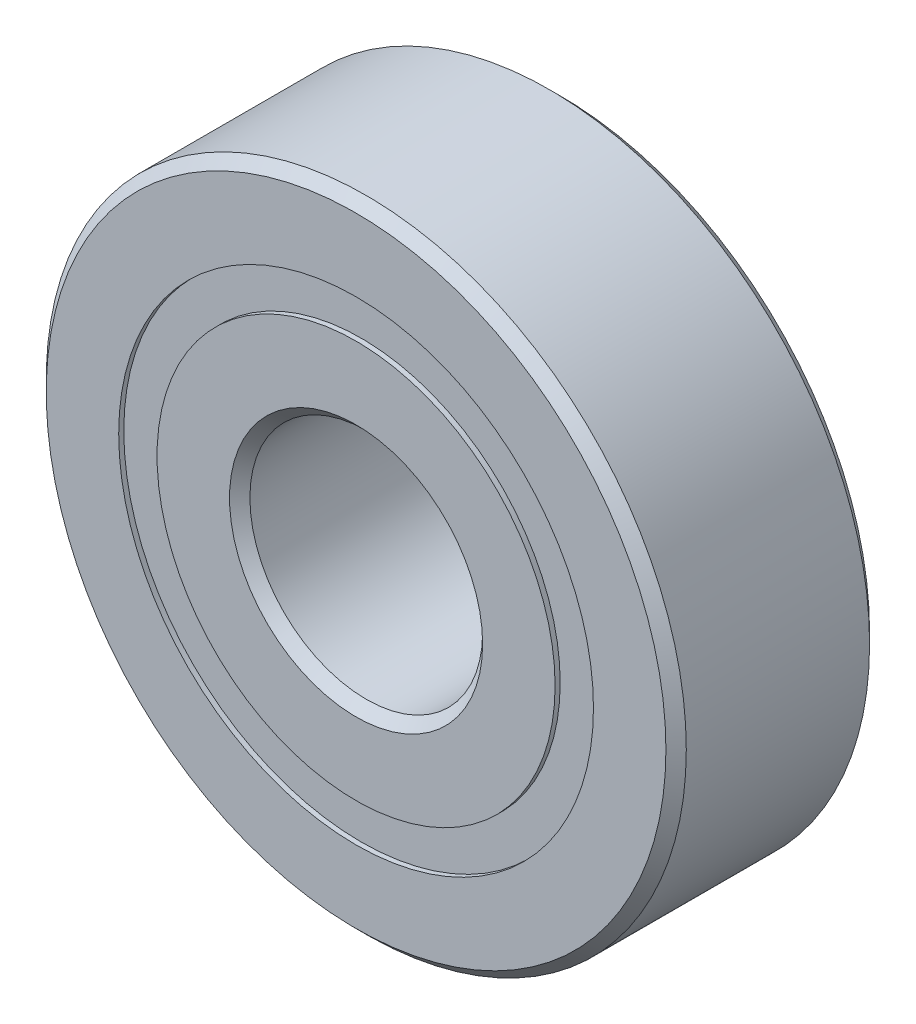
ISO-10303-21;
HEADER;
FILE_DESCRIPTION(('STEP AP214'),'2;1');
FILE_NAME('part.step','',(''),(''),'','','');
FILE_SCHEMA(('AUTOMOTIVE_DESIGN { 1 0 10303 214 1 1 1 1 }'));
ENDSEC;
DATA;
#1=APPLICATION_CONTEXT('core data for automotive mechanical design processes');
#2=APPLICATION_PROTOCOL_DEFINITION('international standard','automotive_design',2000,#1);
#3=PRODUCT_CONTEXT('',#1,'mechanical');
#4=PRODUCT('Part','Part','',(#3));
#5=PRODUCT_RELATED_PRODUCT_CATEGORY('part','',(#4));
#6=PRODUCT_DEFINITION_FORMATION('','',#4);
#7=PRODUCT_DEFINITION_CONTEXT('part definition',#1,'design');
#8=PRODUCT_DEFINITION('design','',#6,#7);
#9=PRODUCT_DEFINITION_SHAPE('','',#8);
#10=(LENGTH_UNIT() NAMED_UNIT(*) SI_UNIT(.MILLI.,.METRE.));
#11=(NAMED_UNIT(*) PLANE_ANGLE_UNIT() SI_UNIT($,.RADIAN.));
#12=(NAMED_UNIT(*) SI_UNIT($,.STERADIAN.) SOLID_ANGLE_UNIT());
#13=UNCERTAINTY_MEASURE_WITH_UNIT(LENGTH_MEASURE(1.E-05),#10,'distance_accuracy_value','');
#14=(GEOMETRIC_REPRESENTATION_CONTEXT(3) GLOBAL_UNCERTAINTY_ASSIGNED_CONTEXT((#13)) GLOBAL_UNIT_ASSIGNED_CONTEXT((#10,
#11,#12)) REPRESENTATION_CONTEXT('',''));
#15=CARTESIAN_POINT('',(0.,0.,0.));
#16=DIRECTION('',(0.,0.,1.));
#17=DIRECTION('',(1.,0.,0.));
#18=AXIS2_PLACEMENT_3D('',#15,#16,#17);
#19=CARTESIAN_POINT('',(0.,8.15934065934066,-3.325));
#20=DIRECTION('',(0.,0.,1.));
#21=DIRECTION('',(1.,0.,0.));
#22=AXIS2_PLACEMENT_3D('',#19,#20,#21);
#23=PLANE('',#22);
#24=CARTESIAN_POINT('',(0.,0.,-3.325));
#25=DIRECTION('',(0.,0.,1.));
#26=DIRECTION('',(1.,0.,0.));
#27=AXIS2_PLACEMENT_3D('',#24,#25,#26);
#28=CIRCLE('',#27,8.15934065934066);
#29=CARTESIAN_POINT('',(8.15934065934066,0.,-3.325));
#30=VERTEX_POINT('',#29);
#31=EDGE_CURVE('E57',#30,#30,#28,.T.);
#32=ORIENTED_EDGE('',*,*,#31,.F.);
#33=EDGE_LOOP('',(#32));
#34=FACE_BOUND('',#33,.T.);
#35=CARTESIAN_POINT('',(0.,0.,-3.325));
#36=DIRECTION('',(0.,0.,1.));
#37=DIRECTION('',(1.,0.,0.));
#38=AXIS2_PLACEMENT_3D('',#35,#36,#37);
#39=CIRCLE('',#38,6.84065934065934);
#40=CARTESIAN_POINT('',(6.84065934065934,0.,-3.325));
#41=VERTEX_POINT('',#40);
#42=EDGE_CURVE('E11',#41,#41,#39,.T.);
#43=ORIENTED_EDGE('',*,*,#42,.T.);
#44=EDGE_LOOP('',(#43));
#45=FACE_BOUND('',#44,.T.);
#46=ADVANCED_FACE('F43',(#34,#45),#23,.F.);
#47=CARTESIAN_POINT('',(0.,0.,3.5));
#48=DIRECTION('',(0.,0.,1.));
#49=DIRECTION('',(1.,0.,0.));
#50=AXIS2_PLACEMENT_3D('',#47,#48,#49);
#51=CYLINDRICAL_SURFACE('',#50,6.84065934065934);
#52=ORIENTED_EDGE('',*,*,#42,.F.);
#53=EDGE_LOOP('',(#52));
#54=FACE_BOUND('',#53,.T.);
#55=CARTESIAN_POINT('',(0.,0.,-1.68952158656808));
#56=DIRECTION('',(0.,0.,1.));
#57=DIRECTION('',(1.,0.,0.));
#58=AXIS2_PLACEMENT_3D('',#55,#56,#57);
#59=CIRCLE('',#58,6.84065934065934);
#60=CARTESIAN_POINT('',(6.84065934065934,0.,-1.68952158656808));
#61=VERTEX_POINT('',#60);
#62=EDGE_CURVE('E49',#61,#61,#59,.T.);
#63=ORIENTED_EDGE('',*,*,#62,.T.);
#64=EDGE_LOOP('',(#63));
#65=FACE_BOUND('',#64,.T.);
#66=ADVANCED_FACE('F66',(#54,#65),#51,.F.);
#67=CARTESIAN_POINT('',(0.,8.15934065934066,-1.68952158656808));
#68=DIRECTION('',(0.,0.,-1.));
#69=DIRECTION('',(-1.,0.,0.));
#70=AXIS2_PLACEMENT_3D('',#67,#68,#69);
#71=PLANE('',#70);
#72=ORIENTED_EDGE('',*,*,#62,.F.);
#73=EDGE_LOOP('',(#72));
#74=FACE_BOUND('',#73,.T.);
#75=CARTESIAN_POINT('',(0.,0.,-1.68952158656808));
#76=DIRECTION('',(0.,0.,1.));
#77=DIRECTION('',(1.,0.,0.));
#78=AXIS2_PLACEMENT_3D('',#75,#76,#77);
#79=CIRCLE('',#78,8.15934065934066);
#80=CARTESIAN_POINT('',(8.15934065934066,0.,-1.68952158656808));
#81=VERTEX_POINT('',#80);
#82=EDGE_CURVE('E53',#81,#81,#79,.T.);
#83=ORIENTED_EDGE('',*,*,#82,.T.);
#84=EDGE_LOOP('',(#83));
#85=FACE_BOUND('',#84,.T.);
#86=ADVANCED_FACE('F70',(#74,#85),#71,.F.);
#87=CARTESIAN_POINT('',(0.,0.,3.5));
#88=DIRECTION('',(0.,0.,1.));
#89=DIRECTION('',(1.,0.,0.));
#90=AXIS2_PLACEMENT_3D('',#87,#88,#89);
#91=CYLINDRICAL_SURFACE('',#90,8.15934065934066);
#92=ORIENTED_EDGE('',*,*,#82,.F.);
#93=EDGE_LOOP('',(#92));
#94=FACE_BOUND('',#93,.T.);
#95=ORIENTED_EDGE('',*,*,#31,.T.);
#96=EDGE_LOOP('',(#95));
#97=FACE_BOUND('',#96,.T.);
#98=ADVANCED_FACE('F63',(#94,#97),#91,.T.);
#99=CLOSED_SHELL('',(#46,#66,#86,#98));
#100=MANIFOLD_SOLID_BREP('B2',#99);
#101=CARTESIAN_POINT('',(0.,8.15934065934066,3.325));
#102=DIRECTION('',(0.,0.,-1.));
#103=DIRECTION('',(-1.,0.,0.));
#104=AXIS2_PLACEMENT_3D('',#101,#102,#103);
#105=PLANE('',#104);
#106=CARTESIAN_POINT('',(0.,0.,3.325));
#107=DIRECTION('',(0.,0.,1.));
#108=DIRECTION('',(1.,0.,0.));
#109=AXIS2_PLACEMENT_3D('',#106,#107,#108);
#110=CIRCLE('',#109,6.84065934065934);
#111=CARTESIAN_POINT('',(6.84065934065934,0.,3.325));
#112=VERTEX_POINT('',#111);
#113=EDGE_CURVE('E42',#112,#112,#110,.T.);
#114=ORIENTED_EDGE('',*,*,#113,.F.);
#115=EDGE_LOOP('',(#114));
#116=FACE_BOUND('',#115,.T.);
#117=CARTESIAN_POINT('',(0.,0.,3.325));
#118=DIRECTION('',(0.,0.,1.));
#119=DIRECTION('',(1.,0.,0.));
#120=AXIS2_PLACEMENT_3D('',#117,#118,#119);
#121=CIRCLE('',#120,8.15934065934066);
#122=CARTESIAN_POINT('',(8.15934065934066,0.,3.325));
#123=VERTEX_POINT('',#122);
#124=EDGE_CURVE('E124',#123,#123,#121,.T.);
#125=ORIENTED_EDGE('',*,*,#124,.T.);
#126=EDGE_LOOP('',(#125));
#127=FACE_BOUND('',#126,.T.);
#128=ADVANCED_FACE('F110',(#116,#127),#105,.F.);
#129=CARTESIAN_POINT('',(0.,0.,3.5));
#130=DIRECTION('',(0.,0.,1.));
#131=DIRECTION('',(1.,0.,0.));
#132=AXIS2_PLACEMENT_3D('',#129,#130,#131);
#133=CYLINDRICAL_SURFACE('',#132,6.84065934065934);
#134=CARTESIAN_POINT('',(0.,0.,1.68952158656808));
#135=DIRECTION('',(0.,0.,1.));
#136=DIRECTION('',(1.,0.,0.));
#137=AXIS2_PLACEMENT_3D('',#134,#135,#136);
#138=CIRCLE('',#137,6.84065934065934);
#139=CARTESIAN_POINT('',(6.84065934065934,0.,1.68952158656808));
#140=VERTEX_POINT('',#139);
#141=EDGE_CURVE('E116',#140,#140,#138,.T.);
#142=ORIENTED_EDGE('',*,*,#141,.F.);
#143=EDGE_LOOP('',(#142));
#144=FACE_BOUND('',#143,.T.);
#145=ORIENTED_EDGE('',*,*,#113,.T.);
#146=EDGE_LOOP('',(#145));
#147=FACE_BOUND('',#146,.T.);
#148=ADVANCED_FACE('F139',(#144,#147),#133,.F.);
#149=CARTESIAN_POINT('',(0.,8.15934065934066,1.68952158656808));
#150=DIRECTION('',(0.,0.,1.));
#151=DIRECTION('',(1.,0.,0.));
#152=AXIS2_PLACEMENT_3D('',#149,#150,#151);
#153=PLANE('',#152);
#154=CARTESIAN_POINT('',(0.,0.,1.68952158656808));
#155=DIRECTION('',(0.,0.,1.));
#156=DIRECTION('',(1.,0.,0.));
#157=AXIS2_PLACEMENT_3D('',#154,#155,#156);
#158=CIRCLE('',#157,8.15934065934066);
#159=CARTESIAN_POINT('',(8.15934065934066,0.,1.68952158656808));
#160=VERTEX_POINT('',#159);
#161=EDGE_CURVE('E120',#160,#160,#158,.T.);
#162=ORIENTED_EDGE('',*,*,#161,.F.);
#163=EDGE_LOOP('',(#162));
#164=FACE_BOUND('',#163,.T.);
#165=ORIENTED_EDGE('',*,*,#141,.T.);
#166=EDGE_LOOP('',(#165));
#167=FACE_BOUND('',#166,.T.);
#168=ADVANCED_FACE('F134',(#164,#167),#153,.F.);
#169=CARTESIAN_POINT('',(0.,0.,3.5));
#170=DIRECTION('',(0.,0.,1.));
#171=DIRECTION('',(1.,0.,0.));
#172=AXIS2_PLACEMENT_3D('',#169,#170,#171);
#173=CYLINDRICAL_SURFACE('',#172,8.15934065934066);
#174=ORIENTED_EDGE('',*,*,#124,.F.);
#175=EDGE_LOOP('',(#174));
#176=FACE_BOUND('',#175,.T.);
#177=ORIENTED_EDGE('',*,*,#161,.T.);
#178=EDGE_LOOP('',(#177));
#179=FACE_BOUND('',#178,.T.);
#180=ADVANCED_FACE('F131',(#176,#179),#173,.T.);
#181=CLOSED_SHELL('',(#128,#148,#168,#180));
#182=MANIFOLD_SOLID_BREP('B6',#181);
#183=CARTESIAN_POINT('',(-3.74999999999992,6.49519052838334,0.));
#184=DIRECTION('',(0.,0.,1.));
#185=DIRECTION('',(-0.499999999999989,0.866025403784445,0.));
#186=AXIS2_PLACEMENT_3D('',#183,#184,#185);
#187=SPHERICAL_SURFACE('',#186,1.68952158656808);
#188=CARTESIAN_POINT('',(-3.74999999999992,6.49519052838334,1.68952158656808));
#189=VERTEX_POINT('',#188);
#190=VERTEX_LOOP('',#189);
#191=FACE_BOUND('',#190,.T.);
#192=ADVANCED_FACE('F177',(#191),#187,.T.);
#193=CLOSED_SHELL('',(#192));
#194=MANIFOLD_SOLID_BREP('B37',#193);
#195=CARTESIAN_POINT('',(-6.49519052838325,3.75000000000008,0.));
#196=DIRECTION('',(0.,0.,1.));
#197=DIRECTION('',(-0.866025403784433,0.50000000000001,0.));
#198=AXIS2_PLACEMENT_3D('',#195,#196,#197);
#199=SPHERICAL_SURFACE('',#198,1.68952158656808);
#200=CARTESIAN_POINT('',(-6.49519052838325,3.75000000000008,1.68952158656808));
#201=VERTEX_POINT('',#200);
#202=VERTEX_LOOP('',#201);
#203=FACE_BOUND('',#202,.T.);
#204=ADVANCED_FACE('F197',(#203),#199,.T.);
#205=CLOSED_SHELL('',(#204));
#206=MANIFOLD_SOLID_BREP('B106',#205);
#207=CARTESIAN_POINT('',(-7.5,0.,0.));
#208=DIRECTION('',(0.,0.,1.));
#209=DIRECTION('',(-1.,0.,0.));
#210=AXIS2_PLACEMENT_3D('',#207,#208,#209);
#211=SPHERICAL_SURFACE('',#210,1.68952158656808);
#212=CARTESIAN_POINT('',(-7.5,0.,1.68952158656808));
#213=VERTEX_POINT('',#212);
#214=VERTEX_LOOP('',#213);
#215=FACE_BOUND('',#214,.T.);
#216=ADVANCED_FACE('F217',(#215),#211,.T.);
#217=CLOSED_SHELL('',(#216));
#218=MANIFOLD_SOLID_BREP('B173',#217);
#219=CARTESIAN_POINT('',(-6.49519052838332,-3.74999999999994,0.));
#220=DIRECTION('',(0.,0.,1.));
#221=DIRECTION('',(-0.866025403784443,-0.499999999999992,0.));
#222=AXIS2_PLACEMENT_3D('',#219,#220,#221);
#223=SPHERICAL_SURFACE('',#222,1.68952158656808);
#224=CARTESIAN_POINT('',(-6.49519052838332,-3.74999999999994,1.68952158656808));
#225=VERTEX_POINT('',#224);
#226=VERTEX_LOOP('',#225);
#227=FACE_BOUND('',#226,.T.);
#228=ADVANCED_FACE('F237',(#227),#223,.T.);
#229=CLOSED_SHELL('',(#228));
#230=MANIFOLD_SOLID_BREP('B193',#229);
#231=CARTESIAN_POINT('',(-3.75000000000005,-6.49519052838326,0.));
#232=DIRECTION('',(0.,0.,1.));
#233=DIRECTION('',(-0.500000000000007,-0.866025403784435,0.));
#234=AXIS2_PLACEMENT_3D('',#231,#232,#233);
#235=SPHERICAL_SURFACE('',#234,1.68952158656808);
#236=CARTESIAN_POINT('',(-3.75000000000005,-6.49519052838326,1.68952158656808));
#237=VERTEX_POINT('',#236);
#238=VERTEX_LOOP('',#237);
#239=FACE_BOUND('',#238,.T.);
#240=ADVANCED_FACE('F257',(#239),#235,.T.);
#241=CLOSED_SHELL('',(#240));
#242=MANIFOLD_SOLID_BREP('B213',#241);
#243=CARTESIAN_POINT('',(0.,-7.5,0.));
#244=DIRECTION('',(0.,0.,1.));
#245=DIRECTION('',(0.,-1.,0.));
#246=AXIS2_PLACEMENT_3D('',#243,#244,#245);
#247=SPHERICAL_SURFACE('',#246,1.68952158656808);
#248=CARTESIAN_POINT('',(0.,-7.5,1.68952158656808));
#249=VERTEX_POINT('',#248);
#250=VERTEX_LOOP('',#249);
#251=FACE_BOUND('',#250,.T.);
#252=ADVANCED_FACE('F277',(#251),#247,.T.);
#253=CLOSED_SHELL('',(#252));
#254=MANIFOLD_SOLID_BREP('B233',#253);
#255=CARTESIAN_POINT('',(3.74999999999996,-6.49519052838331,0.));
#256=DIRECTION('',(0.,0.,1.));
#257=DIRECTION('',(0.499999999999995,-0.866025403784442,0.));
#258=AXIS2_PLACEMENT_3D('',#255,#256,#257);
#259=SPHERICAL_SURFACE('',#258,1.68952158656808);
#260=CARTESIAN_POINT('',(3.74999999999996,-6.49519052838331,1.68952158656808));
#261=VERTEX_POINT('',#260);
#262=VERTEX_LOOP('',#261);
#263=FACE_BOUND('',#262,.T.);
#264=ADVANCED_FACE('F297',(#263),#259,.T.);
#265=CLOSED_SHELL('',(#264));
#266=MANIFOLD_SOLID_BREP('B253',#265);
#267=CARTESIAN_POINT('',(6.49519052838327,-3.75000000000003,0.));
#268=DIRECTION('',(0.,0.,1.));
#269=DIRECTION('',(0.866025403784436,-0.500000000000004,0.));
#270=AXIS2_PLACEMENT_3D('',#267,#268,#269);
#271=SPHERICAL_SURFACE('',#270,1.68952158656808);
#272=CARTESIAN_POINT('',(6.49519052838327,-3.75000000000003,1.68952158656808));
#273=VERTEX_POINT('',#272);
#274=VERTEX_LOOP('',#273);
#275=FACE_BOUND('',#274,.T.);
#276=ADVANCED_FACE('F317',(#275),#271,.T.);
#277=CLOSED_SHELL('',(#276));
#278=MANIFOLD_SOLID_BREP('B273',#277);
#279=CARTESIAN_POINT('',(7.5,0.,0.));
#280=DIRECTION('',(0.,0.,1.));
#281=DIRECTION('',(1.,0.,0.));
#282=AXIS2_PLACEMENT_3D('',#279,#280,#281);
#283=SPHERICAL_SURFACE('',#282,1.68952158656808);
#284=CARTESIAN_POINT('',(7.5,0.,1.68952158656808));
#285=VERTEX_POINT('',#284);
#286=VERTEX_LOOP('',#285);
#287=FACE_BOUND('',#286,.T.);
#288=ADVANCED_FACE('F337',(#287),#283,.T.);
#289=CLOSED_SHELL('',(#288));
#290=MANIFOLD_SOLID_BREP('B293',#289);
#291=CARTESIAN_POINT('',(6.4951905283833,3.74999999999998,0.));
#292=DIRECTION('',(0.,0.,1.));
#293=DIRECTION('',(0.86602540378444,0.499999999999998,0.));
#294=AXIS2_PLACEMENT_3D('',#291,#292,#293);
#295=SPHERICAL_SURFACE('',#294,1.68952158656808);
#296=CARTESIAN_POINT('',(6.4951905283833,3.74999999999998,1.68952158656808));
#297=VERTEX_POINT('',#296);
#298=VERTEX_LOOP('',#297);
#299=FACE_BOUND('',#298,.T.);
#300=ADVANCED_FACE('F357',(#299),#295,.T.);
#301=CLOSED_SHELL('',(#300));
#302=MANIFOLD_SOLID_BREP('B313',#301);
#303=CARTESIAN_POINT('',(3.75000000000001,6.49519052838328,0.));
#304=DIRECTION('',(0.,0.,1.));
#305=DIRECTION('',(0.500000000000001,0.866025403784438,0.));
#306=AXIS2_PLACEMENT_3D('',#303,#304,#305);
#307=SPHERICAL_SURFACE('',#306,1.68952158656808);
#308=CARTESIAN_POINT('',(3.75000000000001,6.49519052838328,1.68952158656808));
#309=VERTEX_POINT('',#308);
#310=VERTEX_LOOP('',#309);
#311=FACE_BOUND('',#310,.T.);
#312=ADVANCED_FACE('F377',(#311),#307,.T.);
#313=CLOSED_SHELL('',(#312));
#314=MANIFOLD_SOLID_BREP('B333',#313);
#315=CARTESIAN_POINT('',(0.,7.5,0.));
#316=DIRECTION('',(0.,0.,1.));
#317=DIRECTION('',(0.,1.,0.));
#318=AXIS2_PLACEMENT_3D('',#315,#316,#317);
#319=SPHERICAL_SURFACE('',#318,1.68952158656808);
#320=CARTESIAN_POINT('',(0.,7.5,1.68952158656808));
#321=VERTEX_POINT('',#320);
#322=VERTEX_LOOP('',#321);
#323=FACE_BOUND('',#322,.T.);
#324=ADVANCED_FACE('F399',(#323),#319,.T.);
#325=CLOSED_SHELL('',(#324));
#326=MANIFOLD_SOLID_BREP('B353',#325);
#327=CARTESIAN_POINT('',(0.,6.84065934065934,3.5));
#328=DIRECTION('',(0.,0.,-1.));
#329=DIRECTION('',(-1.,0.,0.));
#330=AXIS2_PLACEMENT_3D('',#327,#328,#329);
#331=PLANE('',#330);
#332=CARTESIAN_POINT('',(0.,0.,3.5));
#333=DIRECTION('',(0.,0.,1.));
#334=DIRECTION('',(1.,0.,0.));
#335=AXIS2_PLACEMENT_3D('',#332,#333,#334);
#336=CIRCLE('',#335,4.35);
#337=CARTESIAN_POINT('',(4.35,0.,3.5));
#338=VERTEX_POINT('',#337);
#339=EDGE_CURVE('E446',#338,#338,#336,.T.);
#340=ORIENTED_EDGE('',*,*,#339,.F.);
#341=EDGE_LOOP('',(#340));
#342=FACE_BOUND('',#341,.T.);
#343=CARTESIAN_POINT('',(0.,0.,3.5));
#344=DIRECTION('',(0.,0.,1.));
#345=DIRECTION('',(1.,0.,0.));
#346=AXIS2_PLACEMENT_3D('',#343,#344,#345);
#347=CIRCLE('',#346,6.84065934065934);
#348=CARTESIAN_POINT('',(6.84065934065934,0.,3.5));
#349=VERTEX_POINT('',#348);
#350=EDGE_CURVE('E398',#349,#349,#347,.T.);
#351=ORIENTED_EDGE('',*,*,#350,.T.);
#352=EDGE_LOOP('',(#351));
#353=FACE_BOUND('',#352,.T.);
#354=ADVANCED_FACE('F418',(#342,#353),#331,.F.);
#355=CARTESIAN_POINT('',(0.,0.,3.5));
#356=DIRECTION('',(0.,0.,1.));
#357=DIRECTION('',(1.,0.,0.));
#358=AXIS2_PLACEMENT_3D('',#355,#356,#357);
#359=CYLINDRICAL_SURFACE('',#358,6.84065934065934);
#360=ORIENTED_EDGE('',*,*,#350,.F.);
#361=EDGE_LOOP('',(#360));
#362=FACE_BOUND('',#361,.T.);
#363=CARTESIAN_POINT('',(0.,0.,1.55555555555556));
#364=DIRECTION('',(0.,0.,1.));
#365=DIRECTION('',(1.,0.,0.));
#366=AXIS2_PLACEMENT_3D('',#363,#364,#365);
#367=CIRCLE('',#366,6.84065934065934);
#368=CARTESIAN_POINT('',(6.84065934065934,0.,1.55555555555556));
#369=VERTEX_POINT('',#368);
#370=EDGE_CURVE('E424',#369,#369,#367,.T.);
#371=ORIENTED_EDGE('',*,*,#370,.T.);
#372=EDGE_LOOP('',(#371));
#373=FACE_BOUND('',#372,.T.);
#374=ADVANCED_FACE('F453',(#362,#373),#359,.T.);
#375=CARTESIAN_POINT('',(0.,0.,0.));
#376=DIRECTION('',(0.,0.,1.));
#377=DIRECTION('',(1.,0.,0.));
#378=AXIS2_PLACEMENT_3D('',#375,#376,#377);
#379=TOROIDAL_SURFACE('',#378,7.5,1.68952158656808);
#380=ORIENTED_EDGE('',*,*,#370,.F.);
#381=EDGE_LOOP('',(#380));
#382=FACE_BOUND('',#381,.T.);
#383=CARTESIAN_POINT('',(0.,0.,-1.55555555555556));
#384=DIRECTION('',(0.,0.,1.));
#385=DIRECTION('',(1.,0.,0.));
#386=AXIS2_PLACEMENT_3D('',#383,#384,#385);
#387=CIRCLE('',#386,6.84065934065934);
#388=CARTESIAN_POINT('',(6.84065934065934,0.,-1.55555555555556));
#389=VERTEX_POINT('',#388);
#390=EDGE_CURVE('E428',#389,#389,#387,.T.);
#391=ORIENTED_EDGE('',*,*,#390,.T.);
#392=EDGE_LOOP('',(#391));
#393=FACE_BOUND('',#392,.T.);
#394=ADVANCED_FACE('F457',(#382,#393),#379,.F.);
#395=CARTESIAN_POINT('',(0.,0.,3.5));
#396=DIRECTION('',(0.,0.,1.));
#397=DIRECTION('',(1.,0.,0.));
#398=AXIS2_PLACEMENT_3D('',#395,#396,#397);
#399=CYLINDRICAL_SURFACE('',#398,6.84065934065934);
#400=ORIENTED_EDGE('',*,*,#390,.F.);
#401=EDGE_LOOP('',(#400));
#402=FACE_BOUND('',#401,.T.);
#403=CARTESIAN_POINT('',(0.,0.,-3.5));
#404=DIRECTION('',(0.,0.,1.));
#405=DIRECTION('',(1.,0.,0.));
#406=AXIS2_PLACEMENT_3D('',#403,#404,#405);
#407=CIRCLE('',#406,6.84065934065934);
#408=CARTESIAN_POINT('',(6.84065934065934,0.,-3.5));
#409=VERTEX_POINT('',#408);
#410=EDGE_CURVE('E432',#409,#409,#407,.T.);
#411=ORIENTED_EDGE('',*,*,#410,.T.);
#412=EDGE_LOOP('',(#411));
#413=FACE_BOUND('',#412,.T.);
#414=ADVANCED_FACE('F462',(#402,#413),#399,.T.);
#415=CARTESIAN_POINT('',(0.,4.35,-3.5));
#416=DIRECTION('',(0.,0.,1.));
#417=DIRECTION('',(1.,0.,0.));
#418=AXIS2_PLACEMENT_3D('',#415,#416,#417);
#419=PLANE('',#418);
#420=ORIENTED_EDGE('',*,*,#410,.F.);
#421=EDGE_LOOP('',(#420));
#422=FACE_BOUND('',#421,.T.);
#423=CARTESIAN_POINT('',(0.,0.,-3.5));
#424=DIRECTION('',(0.,0.,1.));
#425=DIRECTION('',(1.,0.,0.));
#426=AXIS2_PLACEMENT_3D('',#423,#424,#425);
#427=CIRCLE('',#426,4.35);
#428=CARTESIAN_POINT('',(4.35,0.,-3.5));
#429=VERTEX_POINT('',#428);
#430=EDGE_CURVE('E437',#429,#429,#427,.T.);
#431=ORIENTED_EDGE('',*,*,#430,.T.);
#432=EDGE_LOOP('',(#431));
#433=FACE_BOUND('',#432,.T.);
#434=ADVANCED_FACE('F468',(#422,#433),#419,.F.);
#435=CARTESIAN_POINT('',(0.,0.,-3.15));
#436=DIRECTION('',(0.,0.,-1.));
#437=DIRECTION('',(-1.,0.,0.));
#438=AXIS2_PLACEMENT_3D('',#435,#436,#437);
#439=CONICAL_SURFACE('',#438,4.,0.78539816339745);
#440=ORIENTED_EDGE('',*,*,#430,.F.);
#441=EDGE_LOOP('',(#440));
#442=FACE_BOUND('',#441,.T.);
#443=CARTESIAN_POINT('',(0.,0.,-3.15));
#444=DIRECTION('',(0.,0.,1.));
#445=DIRECTION('',(1.,0.,0.));
#446=AXIS2_PLACEMENT_3D('',#443,#444,#445);
#447=CIRCLE('',#446,4.);
#448=CARTESIAN_POINT('',(4.,0.,-3.15));
#449=VERTEX_POINT('',#448);
#450=EDGE_CURVE('E440',#449,#449,#447,.T.);
#451=ORIENTED_EDGE('',*,*,#450,.T.);
#452=EDGE_LOOP('',(#451));
#453=FACE_BOUND('',#452,.T.);
#454=ADVANCED_FACE('F472',(#442,#453),#439,.F.);
#455=CARTESIAN_POINT('',(0.,0.,3.5));
#456=DIRECTION('',(0.,0.,1.));
#457=DIRECTION('',(1.,0.,0.));
#458=AXIS2_PLACEMENT_3D('',#455,#456,#457);
#459=CYLINDRICAL_SURFACE('',#458,4.);
#460=ORIENTED_EDGE('',*,*,#450,.F.);
#461=EDGE_LOOP('',(#460));
#462=FACE_BOUND('',#461,.T.);
#463=CARTESIAN_POINT('',(0.,0.,3.15));
#464=DIRECTION('',(0.,0.,1.));
#465=DIRECTION('',(1.,0.,0.));
#466=AXIS2_PLACEMENT_3D('',#463,#464,#465);
#467=CIRCLE('',#466,4.);
#468=CARTESIAN_POINT('',(4.,0.,3.15));
#469=VERTEX_POINT('',#468);
#470=EDGE_CURVE('E443',#469,#469,#467,.T.);
#471=ORIENTED_EDGE('',*,*,#470,.T.);
#472=EDGE_LOOP('',(#471));
#473=FACE_BOUND('',#472,.T.);
#474=ADVANCED_FACE('F476',(#462,#473),#459,.F.);
#475=CARTESIAN_POINT('',(0.,0.,3.5));
#476=DIRECTION('',(0.,0.,1.));
#477=DIRECTION('',(1.,0.,0.));
#478=AXIS2_PLACEMENT_3D('',#475,#476,#477);
#479=CONICAL_SURFACE('',#478,4.35,0.78539816339745);
#480=ORIENTED_EDGE('',*,*,#470,.F.);
#481=EDGE_LOOP('',(#480));
#482=FACE_BOUND('',#481,.T.);
#483=ORIENTED_EDGE('',*,*,#339,.T.);
#484=EDGE_LOOP('',(#483));
#485=FACE_BOUND('',#484,.T.);
#486=ADVANCED_FACE('F450',(#482,#485),#479,.F.);
#487=CLOSED_SHELL('',(#354,#374,#394,#414,#434,#454,#474,#486));
#488=MANIFOLD_SOLID_BREP('B373',#487);
#489=CARTESIAN_POINT('',(0.,0.,3.15));
#490=DIRECTION('',(0.,0.,-1.));
#491=DIRECTION('',(-1.,0.,0.));
#492=AXIS2_PLACEMENT_3D('',#489,#490,#491);
#493=CONICAL_SURFACE('',#492,11.,0.785398163397448);
#494=CARTESIAN_POINT('',(0.,0.,3.5));
#495=DIRECTION('',(0.,0.,1.));
#496=DIRECTION('',(1.,0.,0.));
#497=AXIS2_PLACEMENT_3D('',#494,#495,#496);
#498=CIRCLE('',#497,10.65);
#499=CARTESIAN_POINT('',(10.65,0.,3.5));
#500=VERTEX_POINT('',#499);
#501=EDGE_CURVE('E567',#500,#500,#498,.T.);
#502=ORIENTED_EDGE('',*,*,#501,.F.);
#503=EDGE_LOOP('',(#502));
#504=FACE_BOUND('',#503,.T.);
#505=CARTESIAN_POINT('',(0.,0.,3.15));
#506=DIRECTION('',(0.,0.,1.));
#507=DIRECTION('',(1.,0.,0.));
#508=AXIS2_PLACEMENT_3D('',#505,#506,#507);
#509=CIRCLE('',#508,11.);
#510=CARTESIAN_POINT('',(11.,0.,3.15));
#511=VERTEX_POINT('',#510);
#512=EDGE_CURVE('E417',#511,#511,#509,.T.);
#513=ORIENTED_EDGE('',*,*,#512,.T.);
#514=EDGE_LOOP('',(#513));
#515=FACE_BOUND('',#514,.T.);
#516=ADVANCED_FACE('F539',(#504,#515),#493,.T.);
#517=CARTESIAN_POINT('',(0.,0.,3.5));
#518=DIRECTION('',(0.,0.,1.));
#519=DIRECTION('',(1.,0.,0.));
#520=AXIS2_PLACEMENT_3D('',#517,#518,#519);
#521=CYLINDRICAL_SURFACE('',#520,11.);
#522=ORIENTED_EDGE('',*,*,#512,.F.);
#523=EDGE_LOOP('',(#522));
#524=FACE_BOUND('',#523,.T.);
#525=CARTESIAN_POINT('',(0.,0.,-3.15));
#526=DIRECTION('',(0.,0.,1.));
#527=DIRECTION('',(1.,0.,0.));
#528=AXIS2_PLACEMENT_3D('',#525,#526,#527);
#529=CIRCLE('',#528,11.);
#530=CARTESIAN_POINT('',(11.,0.,-3.15));
#531=VERTEX_POINT('',#530);
#532=EDGE_CURVE('E545',#531,#531,#529,.T.);
#533=ORIENTED_EDGE('',*,*,#532,.T.);
#534=EDGE_LOOP('',(#533));
#535=FACE_BOUND('',#534,.T.);
#536=ADVANCED_FACE('F574',(#524,#535),#521,.T.);
#537=CARTESIAN_POINT('',(0.,0.,-3.5));
#538=DIRECTION('',(0.,0.,1.));
#539=DIRECTION('',(1.,0.,0.));
#540=AXIS2_PLACEMENT_3D('',#537,#538,#539);
#541=CONICAL_SURFACE('',#540,10.65,0.785398163397448);
#542=ORIENTED_EDGE('',*,*,#532,.F.);
#543=EDGE_LOOP('',(#542));
#544=FACE_BOUND('',#543,.T.);
#545=CARTESIAN_POINT('',(0.,0.,-3.5));
#546=DIRECTION('',(0.,0.,1.));
#547=DIRECTION('',(1.,0.,0.));
#548=AXIS2_PLACEMENT_3D('',#545,#546,#547);
#549=CIRCLE('',#548,10.65);
#550=CARTESIAN_POINT('',(10.65,0.,-3.5));
#551=VERTEX_POINT('',#550);
#552=EDGE_CURVE('E549',#551,#551,#549,.T.);
#553=ORIENTED_EDGE('',*,*,#552,.T.);
#554=EDGE_LOOP('',(#553));
#555=FACE_BOUND('',#554,.T.);
#556=ADVANCED_FACE('F578',(#544,#555),#541,.T.);
#557=CARTESIAN_POINT('',(0.,10.65,-3.5));
#558=DIRECTION('',(0.,0.,1.));
#559=DIRECTION('',(1.,0.,0.));
#560=AXIS2_PLACEMENT_3D('',#557,#558,#559);
#561=PLANE('',#560);
#562=ORIENTED_EDGE('',*,*,#552,.F.);
#563=EDGE_LOOP('',(#562));
#564=FACE_BOUND('',#563,.T.);
#565=CARTESIAN_POINT('',(0.,0.,-3.5));
#566=DIRECTION('',(0.,0.,1.));
#567=DIRECTION('',(1.,0.,0.));
#568=AXIS2_PLACEMENT_3D('',#565,#566,#567);
#569=CIRCLE('',#568,8.15934065934066);
#570=CARTESIAN_POINT('',(8.15934065934066,0.,-3.5));
#571=VERTEX_POINT('',#570);
#572=EDGE_CURVE('E553',#571,#571,#569,.T.);
#573=ORIENTED_EDGE('',*,*,#572,.T.);
#574=EDGE_LOOP('',(#573));
#575=FACE_BOUND('',#574,.T.);
#576=ADVANCED_FACE('F583',(#564,#575),#561,.F.);
#577=CARTESIAN_POINT('',(0.,0.,3.5));
#578=DIRECTION('',(0.,0.,1.));
#579=DIRECTION('',(1.,0.,0.));
#580=AXIS2_PLACEMENT_3D('',#577,#578,#579);
#581=CYLINDRICAL_SURFACE('',#580,8.15934065934066);
#582=ORIENTED_EDGE('',*,*,#572,.F.);
#583=EDGE_LOOP('',(#582));
#584=FACE_BOUND('',#583,.T.);
#585=CARTESIAN_POINT('',(0.,0.,-1.55555555555556));
#586=DIRECTION('',(0.,0.,1.));
#587=DIRECTION('',(1.,0.,0.));
#588=AXIS2_PLACEMENT_3D('',#585,#586,#587);
#589=CIRCLE('',#588,8.15934065934066);
#590=CARTESIAN_POINT('',(8.15934065934066,0.,-1.55555555555556));
#591=VERTEX_POINT('',#590);
#592=EDGE_CURVE('E558',#591,#591,#589,.T.);
#593=ORIENTED_EDGE('',*,*,#592,.T.);
#594=EDGE_LOOP('',(#593));
#595=FACE_BOUND('',#594,.T.);
#596=ADVANCED_FACE('F589',(#584,#595),#581,.F.);
#597=CARTESIAN_POINT('',(0.,0.,0.));
#598=DIRECTION('',(0.,0.,1.));
#599=DIRECTION('',(1.,0.,0.));
#600=AXIS2_PLACEMENT_3D('',#597,#598,#599);
#601=TOROIDAL_SURFACE('',#600,7.5,1.68952158656808);
#602=ORIENTED_EDGE('',*,*,#592,.F.);
#603=EDGE_LOOP('',(#602));
#604=FACE_BOUND('',#603,.T.);
#605=CARTESIAN_POINT('',(0.,0.,1.55555555555556));
#606=DIRECTION('',(0.,0.,1.));
#607=DIRECTION('',(1.,0.,0.));
#608=AXIS2_PLACEMENT_3D('',#605,#606,#607);
#609=CIRCLE('',#608,8.15934065934066);
#610=CARTESIAN_POINT('',(8.15934065934066,0.,1.55555555555556));
#611=VERTEX_POINT('',#610);
#612=EDGE_CURVE('E561',#611,#611,#609,.T.);
#613=ORIENTED_EDGE('',*,*,#612,.T.);
#614=EDGE_LOOP('',(#613));
#615=FACE_BOUND('',#614,.T.);
#616=ADVANCED_FACE('F593',(#604,#615),#601,.F.);
#617=CARTESIAN_POINT('',(0.,0.,3.5));
#618=DIRECTION('',(0.,0.,1.));
#619=DIRECTION('',(1.,0.,0.));
#620=AXIS2_PLACEMENT_3D('',#617,#618,#619);
#621=CYLINDRICAL_SURFACE('',#620,8.15934065934066);
#622=ORIENTED_EDGE('',*,*,#612,.F.);
#623=EDGE_LOOP('',(#622));
#624=FACE_BOUND('',#623,.T.);
#625=CARTESIAN_POINT('',(0.,0.,3.5));
#626=DIRECTION('',(0.,0.,1.));
#627=DIRECTION('',(1.,0.,0.));
#628=AXIS2_PLACEMENT_3D('',#625,#626,#627);
#629=CIRCLE('',#628,8.15934065934066);
#630=CARTESIAN_POINT('',(8.15934065934066,0.,3.5));
#631=VERTEX_POINT('',#630);
#632=EDGE_CURVE('E564',#631,#631,#629,.T.);
#633=ORIENTED_EDGE('',*,*,#632,.T.);
#634=EDGE_LOOP('',(#633));
#635=FACE_BOUND('',#634,.T.);
#636=ADVANCED_FACE('F597',(#624,#635),#621,.F.);
#637=CARTESIAN_POINT('',(0.,10.65,3.5));
#638=DIRECTION('',(0.,0.,-1.));
#639=DIRECTION('',(-1.,0.,0.));
#640=AXIS2_PLACEMENT_3D('',#637,#638,#639);
#641=PLANE('',#640);
#642=ORIENTED_EDGE('',*,*,#632,.F.);
#643=EDGE_LOOP('',(#642));
#644=FACE_BOUND('',#643,.T.);
#645=ORIENTED_EDGE('',*,*,#501,.T.);
#646=EDGE_LOOP('',(#645));
#647=FACE_BOUND('',#646,.T.);
#648=ADVANCED_FACE('F571',(#644,#647),#641,.F.);
#649=CLOSED_SHELL('',(#516,#536,#556,#576,#596,#616,#636,#648));
#650=MANIFOLD_SOLID_BREP('B393',#649);
#651=ADVANCED_BREP_SHAPE_REPRESENTATION('',(#18,#100,#182,#194,#206,#218,#230,#242,#254,#266,
#278,#290,#302,#314,#326,#488,#650),#14);
#652=SHAPE_DEFINITION_REPRESENTATION(#9,#651);
ENDSEC;
END-ISO-10303-21;
